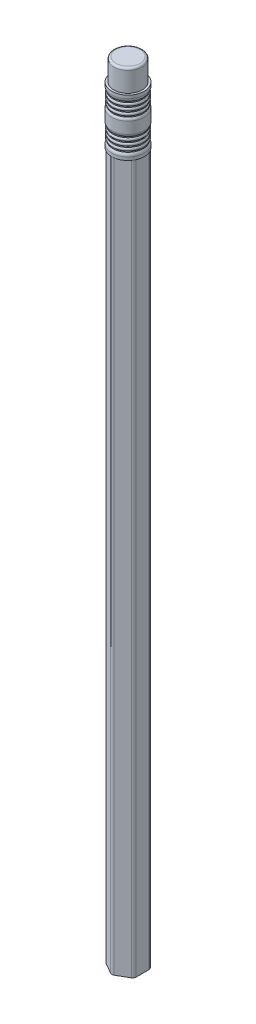
ISO-10303-21;
HEADER;
FILE_DESCRIPTION(('STEP AP214'),'2;1');
FILE_NAME('part.step','',(''),(''),'','','');
FILE_SCHEMA(('AUTOMOTIVE_DESIGN { 1 0 10303 214 1 1 1 1 }'));
ENDSEC;
DATA;
#1=APPLICATION_CONTEXT('core data for automotive mechanical design processes');
#2=APPLICATION_PROTOCOL_DEFINITION('international standard','automotive_design',2000,#1);
#3=PRODUCT_CONTEXT('',#1,'mechanical');
#4=PRODUCT('Part','Part','',(#3));
#5=PRODUCT_RELATED_PRODUCT_CATEGORY('part','',(#4));
#6=PRODUCT_DEFINITION_FORMATION('','',#4);
#7=PRODUCT_DEFINITION_CONTEXT('part definition',#1,'design');
#8=PRODUCT_DEFINITION('design','',#6,#7);
#9=PRODUCT_DEFINITION_SHAPE('','',#8);
#10=(LENGTH_UNIT() NAMED_UNIT(*) SI_UNIT(.MILLI.,.METRE.));
#11=(NAMED_UNIT(*) PLANE_ANGLE_UNIT() SI_UNIT($,.RADIAN.));
#12=(NAMED_UNIT(*) SI_UNIT($,.STERADIAN.) SOLID_ANGLE_UNIT());
#13=UNCERTAINTY_MEASURE_WITH_UNIT(LENGTH_MEASURE(1.E-05),#10,'distance_accuracy_value','');
#14=(GEOMETRIC_REPRESENTATION_CONTEXT(3) GLOBAL_UNCERTAINTY_ASSIGNED_CONTEXT((#13)) GLOBAL_UNIT_ASSIGNED_CONTEXT((#10,
#11,#12)) REPRESENTATION_CONTEXT('',''));
#15=CARTESIAN_POINT('',(0.,0.,0.));
#16=DIRECTION('',(0.,0.,1.));
#17=DIRECTION('',(1.,0.,0.));
#18=AXIS2_PLACEMENT_3D('',#15,#16,#17);
#19=CARTESIAN_POINT('',(0.,177.8,0.));
#20=DIRECTION('',(0.,-1.,0.));
#21=DIRECTION('',(0.,0.,-1.));
#22=AXIS2_PLACEMENT_3D('',#19,#20,#21);
#23=CYLINDRICAL_SURFACE('',#22,0.9398);
#24=CARTESIAN_POINT('',(0.,177.8,0.));
#25=DIRECTION('',(0.,1.,0.));
#26=DIRECTION('',(0.,0.,1.));
#27=AXIS2_PLACEMENT_3D('',#24,#25,#26);
#28=CIRCLE('',#27,0.9398);
#29=CARTESIAN_POINT('',(0.,177.8,0.9398));
#30=VERTEX_POINT('',#29);
#31=EDGE_CURVE('E215',#30,#30,#28,.T.);
#32=ORIENTED_EDGE('',*,*,#31,.F.);
#33=EDGE_LOOP('',(#32));
#34=FACE_BOUND('',#33,.T.);
#35=CARTESIAN_POINT('',(0.,0.,0.));
#36=DIRECTION('',(0.,1.,0.));
#37=DIRECTION('',(0.,0.,1.));
#38=AXIS2_PLACEMENT_3D('',#35,#36,#37);
#39=CIRCLE('',#38,0.9398);
#40=CARTESIAN_POINT('',(0.,0.,0.9398));
#41=VERTEX_POINT('',#40);
#42=EDGE_CURVE('E218',#41,#41,#39,.T.);
#43=ORIENTED_EDGE('',*,*,#42,.T.);
#44=EDGE_LOOP('',(#43));
#45=FACE_BOUND('',#44,.T.);
#46=ADVANCED_FACE('F32',(#34,#45),#23,.T.);
#47=CARTESIAN_POINT('',(0.,0.,0.));
#48=DIRECTION('',(0.,1.,0.));
#49=DIRECTION('',(0.,0.,1.));
#50=AXIS2_PLACEMENT_3D('',#47,#48,#49);
#51=PLANE('',#50);
#52=ORIENTED_EDGE('',*,*,#42,.F.);
#53=EDGE_LOOP('',(#52));
#54=FACE_BOUND('',#53,.T.);
#55=ADVANCED_FACE('F240',(#54),#51,.F.);
#56=CARTESIAN_POINT('',(0.,177.8,0.));
#57=DIRECTION('',(0.,1.,0.));
#58=DIRECTION('',(0.,0.,1.));
#59=AXIS2_PLACEMENT_3D('',#56,#57,#58);
#60=PLANE('',#59);
#61=CARTESIAN_POINT('',(0.,177.8,0.));
#62=DIRECTION('',(0.,1.,0.));
#63=DIRECTION('',(0.,0.,1.));
#64=AXIS2_PLACEMENT_3D('',#61,#62,#63);
#65=CIRCLE('',#64,0.946620370370371);
#66=CARTESIAN_POINT('',(0.,177.8,0.946620370370371));
#67=VERTEX_POINT('',#66);
#68=EDGE_CURVE('E221',#67,#67,#65,.F.);
#69=ORIENTED_EDGE('',*,*,#68,.T.);
#70=EDGE_LOOP('',(#69));
#71=FACE_BOUND('',#70,.T.);
#72=ORIENTED_EDGE('',*,*,#31,.T.);
#73=EDGE_LOOP('',(#72));
#74=FACE_BOUND('',#73,.T.);
#75=ADVANCED_FACE('F245',(#71,#74),#60,.F.);
#76=CARTESIAN_POINT('',(0.,185.166,0.));
#77=DIRECTION('',(0.,-1.,0.));
#78=DIRECTION('',(0.,0.,-1.));
#79=AXIS2_PLACEMENT_3D('',#76,#77,#78);
#80=CONICAL_SURFACE('',#79,0.939800000000001,0.000925925661315221);
#81=CARTESIAN_POINT('',(0.,171.45,0.));
#82=DIRECTION('',(0.,-1.,0.));
#83=DIRECTION('',(0.,0.,-1.));
#84=AXIS2_PLACEMENT_3D('',#81,#82,#83);
#85=CIRCLE('',#84,0.9525);
#86=CARTESIAN_POINT('',(0.,171.45,-0.9525));
#87=VERTEX_POINT('',#86);
#88=EDGE_CURVE('E408',#87,#87,#85,.T.);
#89=ORIENTED_EDGE('',*,*,#88,.T.);
#90=EDGE_LOOP('',(#89));
#91=FACE_BOUND('',#90,.T.);
#92=ORIENTED_EDGE('',*,*,#68,.F.);
#93=EDGE_LOOP('',(#92));
#94=FACE_BOUND('',#93,.T.);
#95=ADVANCED_FACE('F253',(#91,#94),#80,.F.);
#96=CARTESIAN_POINT('',(0.,185.166,-0.939800000000001));
#97=DIRECTION('',(0.,1.,0.));
#98=DIRECTION('',(0.,0.,1.));
#99=AXIS2_PLACEMENT_3D('',#96,#97,#98);
#100=PLANE('',#99);
#101=CARTESIAN_POINT('',(0.,185.166,0.));
#102=DIRECTION('',(0.,-1.,0.));
#103=DIRECTION('',(0.,0.,-1.));
#104=AXIS2_PLACEMENT_3D('',#101,#102,#103);
#105=CIRCLE('',#104,3.93699999999998);
#106=CARTESIAN_POINT('',(0.,185.166,-3.93699999999998));
#107=VERTEX_POINT('',#106);
#108=EDGE_CURVE('E411',#107,#107,#105,.T.);
#109=ORIENTED_EDGE('',*,*,#108,.F.);
#110=EDGE_LOOP('',(#109));
#111=FACE_BOUND('',#110,.T.);
#112=CARTESIAN_POINT('',(0.,185.166,0.));
#113=DIRECTION('',(0.,1.,0.));
#114=DIRECTION('',(0.,0.,1.));
#115=AXIS2_PLACEMENT_3D('',#112,#113,#114);
#116=CIRCLE('',#115,3.429);
#117=CARTESIAN_POINT('',(0.,185.166,3.429));
#118=VERTEX_POINT('',#117);
#119=EDGE_CURVE('E214',#118,#118,#116,.T.);
#120=ORIENTED_EDGE('',*,*,#119,.F.);
#121=EDGE_LOOP('',(#120));
#122=FACE_BOUND('',#121,.T.);
#123=ADVANCED_FACE('F303',(#111,#122),#100,.T.);
#124=CARTESIAN_POINT('',(-2.7305,0.,1.57645491002227));
#125=DIRECTION('',(0.,1.,0.));
#126=DIRECTION('',(0.,0.,1.));
#127=AXIS2_PLACEMENT_3D('',#124,#125,#126);
#128=PLANE('',#127);
#129=CARTESIAN_POINT('',(-2.7305,0.,1.57645491002227));
#130=DIRECTION('',(0.,1.,0.));
#131=DIRECTION('',(0.,0.,1.));
#132=AXIS2_PLACEMENT_3D('',#129,#130,#131);
#133=CIRCLE('',#132,0.762);
#134=CARTESIAN_POINT('',(-3.4925,0.,1.57645491002227));
#135=VERTEX_POINT('',#134);
#136=CARTESIAN_POINT('',(-3.1115,0.,2.23636626770602));
#137=VERTEX_POINT('',#136);
#138=EDGE_CURVE('E166',#135,#137,#133,.T.);
#139=ORIENTED_EDGE('',*,*,#138,.F.);
#140=DIRECTION('',(0.,0.,1.));
#141=VECTOR('',#140,1.);
#142=CARTESIAN_POINT('',(-3.4925,0.,-1.57645491002227));
#143=LINE('',#142,#141);
#144=CARTESIAN_POINT('',(-3.4925,0.,-1.57645491002227));
#145=VERTEX_POINT('',#144);
#146=EDGE_CURVE('E95',#145,#135,#143,.T.);
#147=ORIENTED_EDGE('',*,*,#146,.F.);
#148=CARTESIAN_POINT('',(-2.7305,0.,-1.57645491002227));
#149=DIRECTION('',(0.,1.,0.));
#150=DIRECTION('',(0.,0.,1.));
#151=AXIS2_PLACEMENT_3D('',#148,#149,#150);
#152=CIRCLE('',#151,0.762);
#153=CARTESIAN_POINT('',(-3.1115,0.,-2.23636626770602));
#154=VERTEX_POINT('',#153);
#155=EDGE_CURVE('E89',#154,#145,#152,.T.);
#156=ORIENTED_EDGE('',*,*,#155,.F.);
#157=DIRECTION('',(-0.866025403784439,0.,0.5));
#158=VECTOR('',#157,1.);
#159=CARTESIAN_POINT('',(-0.381,0.,-3.81282117772829));
#160=LINE('',#159,#158);
#161=CARTESIAN_POINT('',(-0.381,0.,-3.81282117772829));
#162=VERTEX_POINT('',#161);
#163=EDGE_CURVE('E185',#162,#154,#160,.T.);
#164=ORIENTED_EDGE('',*,*,#163,.F.);
#165=CARTESIAN_POINT('',(0.,0.,-3.15290982004455));
#166=DIRECTION('',(0.,1.,0.));
#167=DIRECTION('',(0.,0.,1.));
#168=AXIS2_PLACEMENT_3D('',#165,#166,#167);
#169=CIRCLE('',#168,0.762);
#170=CARTESIAN_POINT('',(0.381000000000001,0.,-3.81282117772829));
#171=VERTEX_POINT('',#170);
#172=EDGE_CURVE('E138',#171,#162,#169,.T.);
#173=ORIENTED_EDGE('',*,*,#172,.F.);
#174=DIRECTION('',(-0.866025403784439,0.,-0.5));
#175=VECTOR('',#174,1.);
#176=CARTESIAN_POINT('',(3.1115,0.,-2.23636626770602));
#177=LINE('',#176,#175);
#178=CARTESIAN_POINT('',(3.1115,0.,-2.23636626770602));
#179=VERTEX_POINT('',#178);
#180=EDGE_CURVE('E182',#179,#171,#177,.T.);
#181=ORIENTED_EDGE('',*,*,#180,.F.);
#182=CARTESIAN_POINT('',(2.7305,0.,-1.57645491002227));
#183=DIRECTION('',(0.,1.,0.));
#184=DIRECTION('',(0.,0.,1.));
#185=AXIS2_PLACEMENT_3D('',#182,#183,#184);
#186=CIRCLE('',#185,0.762);
#187=CARTESIAN_POINT('',(3.4925,0.,-1.57645491002227));
#188=VERTEX_POINT('',#187);
#189=EDGE_CURVE('E180',#188,#179,#186,.T.);
#190=ORIENTED_EDGE('',*,*,#189,.F.);
#191=DIRECTION('',(0.,0.,-1.));
#192=VECTOR('',#191,1.);
#193=CARTESIAN_POINT('',(3.4925,0.,1.57645491002227));
#194=LINE('',#193,#192);
#195=CARTESIAN_POINT('',(3.4925,0.,1.57645491002227));
#196=VERTEX_POINT('',#195);
#197=EDGE_CURVE('E178',#196,#188,#194,.T.);
#198=ORIENTED_EDGE('',*,*,#197,.F.);
#199=CARTESIAN_POINT('',(2.7305,0.,1.57645491002227));
#200=DIRECTION('',(0.,1.,0.));
#201=DIRECTION('',(0.,0.,1.));
#202=AXIS2_PLACEMENT_3D('',#199,#200,#201);
#203=CIRCLE('',#202,0.762);
#204=CARTESIAN_POINT('',(3.1115,0.,2.23636626770602));
#205=VERTEX_POINT('',#204);
#206=EDGE_CURVE('E176',#205,#196,#203,.T.);
#207=ORIENTED_EDGE('',*,*,#206,.F.);
#208=DIRECTION('',(0.866025403784439,0.,-0.5));
#209=VECTOR('',#208,1.);
#210=CARTESIAN_POINT('',(0.381,0.,3.81282117772829));
#211=LINE('',#210,#209);
#212=CARTESIAN_POINT('',(0.381,0.,3.81282117772829));
#213=VERTEX_POINT('',#212);
#214=EDGE_CURVE('E174',#213,#205,#211,.T.);
#215=ORIENTED_EDGE('',*,*,#214,.F.);
#216=CARTESIAN_POINT('',(0.,0.,3.15290982004455));
#217=DIRECTION('',(0.,1.,0.));
#218=DIRECTION('',(0.,0.,-1.));
#219=AXIS2_PLACEMENT_3D('',#216,#217,#218);
#220=CIRCLE('',#219,0.762);
#221=CARTESIAN_POINT('',(-0.381,0.,3.81282117772829));
#222=VERTEX_POINT('',#221);
#223=EDGE_CURVE('E172',#222,#213,#220,.T.);
#224=ORIENTED_EDGE('',*,*,#223,.F.);
#225=DIRECTION('',(0.866025403784439,0.,0.5));
#226=VECTOR('',#225,1.);
#227=CARTESIAN_POINT('',(-3.1115,0.,2.23636626770602));
#228=LINE('',#227,#226);
#229=EDGE_CURVE('E169',#137,#222,#228,.T.);
#230=ORIENTED_EDGE('',*,*,#229,.F.);
#231=EDGE_LOOP('',(#139,#147,#156,#164,#173,#181,#190,#198,#207,#215,#224,#230));
#232=FACE_BOUND('',#231,.T.);
#233=CARTESIAN_POINT('',(0.,0.,0.));
#234=DIRECTION('',(0.,1.,0.));
#235=DIRECTION('',(0.,0.,1.));
#236=AXIS2_PLACEMENT_3D('',#233,#234,#235);
#237=CIRCLE('',#236,0.9525);
#238=CARTESIAN_POINT('',(0.,0.,0.9525));
#239=VERTEX_POINT('',#238);
#240=EDGE_CURVE('E170',#239,#239,#237,.T.);
#241=ORIENTED_EDGE('',*,*,#240,.T.);
#242=EDGE_LOOP('',(#241));
#243=FACE_BOUND('',#242,.T.);
#244=ADVANCED_FACE('F262',(#232,#243),#128,.F.);
#245=CARTESIAN_POINT('',(-2.7305,171.45,1.57645491002227));
#246=DIRECTION('',(0.,-1.,0.));
#247=DIRECTION('',(0.,0.,-1.));
#248=AXIS2_PLACEMENT_3D('',#245,#246,#247);
#249=CYLINDRICAL_SURFACE('',#248,0.762);
#250=ORIENTED_EDGE('',*,*,#138,.T.);
#251=DIRECTION('',(0.,-1.,0.));
#252=VECTOR('',#251,1.);
#253=CARTESIAN_POINT('',(-3.1115,171.45,2.23636626770602));
#254=LINE('',#253,#252);
#255=CARTESIAN_POINT('',(-3.1115,171.45,2.23636626770602));
#256=VERTEX_POINT('',#255);
#257=EDGE_CURVE('E212',#256,#137,#254,.T.);
#258=ORIENTED_EDGE('',*,*,#257,.F.);
#259=CARTESIAN_POINT('',(-2.7305,171.45,1.57645491002227));
#260=DIRECTION('',(0.,1.,0.));
#261=DIRECTION('',(0.,0.,1.));
#262=AXIS2_PLACEMENT_3D('',#259,#260,#261);
#263=CIRCLE('',#262,0.762);
#264=CARTESIAN_POINT('',(-3.4925,171.45,1.57645491002227));
#265=VERTEX_POINT('',#264);
#266=EDGE_CURVE('E189',#265,#256,#263,.T.);
#267=ORIENTED_EDGE('',*,*,#266,.F.);
#268=DIRECTION('',(0.,-1.,0.));
#269=VECTOR('',#268,1.);
#270=CARTESIAN_POINT('',(-3.4925,171.45,1.57645491002227));
#271=LINE('',#270,#269);
#272=EDGE_CURVE('E165',#265,#135,#271,.T.);
#273=ORIENTED_EDGE('',*,*,#272,.T.);
#274=EDGE_LOOP('',(#250,#258,#267,#273));
#275=FACE_BOUND('',#274,.T.);
#276=ADVANCED_FACE('F258',(#275),#249,.T.);
#277=CARTESIAN_POINT('',(-3.1115,171.45,2.23636626770602));
#278=DIRECTION('',(0.5,0.,-0.866025403784438));
#279=DIRECTION('',(-0.866025403784439,0.,-0.5));
#280=AXIS2_PLACEMENT_3D('',#277,#278,#279);
#281=PLANE('',#280);
#282=ORIENTED_EDGE('',*,*,#229,.T.);
#283=DIRECTION('',(0.,-1.,0.));
#284=VECTOR('',#283,1.);
#285=CARTESIAN_POINT('',(-0.381,171.45,3.81282117772829));
#286=LINE('',#285,#284);
#287=CARTESIAN_POINT('',(-0.381,171.45,3.81282117772829));
#288=VERTEX_POINT('',#287);
#289=EDGE_CURVE('E209',#288,#222,#286,.T.);
#290=ORIENTED_EDGE('',*,*,#289,.F.);
#291=DIRECTION('',(0.866025403784439,0.,0.5));
#292=VECTOR('',#291,1.);
#293=CARTESIAN_POINT('',(-3.1115,171.45,2.23636626770602));
#294=LINE('',#293,#292);
#295=EDGE_CURVE('E104',#256,#288,#294,.T.);
#296=ORIENTED_EDGE('',*,*,#295,.F.);
#297=ORIENTED_EDGE('',*,*,#257,.T.);
#298=EDGE_LOOP('',(#282,#290,#296,#297));
#299=FACE_BOUND('',#298,.T.);
#300=ADVANCED_FACE('F261',(#299),#281,.F.);
#301=CARTESIAN_POINT('',(0.,171.45,3.15290982004455));
#302=DIRECTION('',(0.,-1.,0.));
#303=DIRECTION('',(0.,0.,-1.));
#304=AXIS2_PLACEMENT_3D('',#301,#302,#303);
#305=CYLINDRICAL_SURFACE('',#304,0.762);
#306=ORIENTED_EDGE('',*,*,#223,.T.);
#307=DIRECTION('',(0.,-1.,0.));
#308=VECTOR('',#307,1.);
#309=CARTESIAN_POINT('',(0.381,171.45,3.81282117772829));
#310=LINE('',#309,#308);
#311=CARTESIAN_POINT('',(0.381,171.45,3.81282117772829));
#312=VERTEX_POINT('',#311);
#313=EDGE_CURVE('E206',#312,#213,#310,.T.);
#314=ORIENTED_EDGE('',*,*,#313,.F.);
#315=CARTESIAN_POINT('',(0.,171.45,3.15290982004455));
#316=DIRECTION('',(0.,1.,0.));
#317=DIRECTION('',(0.,0.,-1.));
#318=AXIS2_PLACEMENT_3D('',#315,#316,#317);
#319=CIRCLE('',#318,0.762);
#320=EDGE_CURVE('E478',#288,#312,#319,.T.);
#321=ORIENTED_EDGE('',*,*,#320,.F.);
#322=ORIENTED_EDGE('',*,*,#289,.T.);
#323=EDGE_LOOP('',(#306,#314,#321,#322));
#324=FACE_BOUND('',#323,.T.);
#325=ADVANCED_FACE('F266',(#324),#305,.T.);
#326=CARTESIAN_POINT('',(0.381,171.45,3.81282117772829));
#327=DIRECTION('',(-0.5,0.,-0.866025403784438));
#328=DIRECTION('',(-0.866025403784439,0.,0.5));
#329=AXIS2_PLACEMENT_3D('',#326,#327,#328);
#330=PLANE('',#329);
#331=ORIENTED_EDGE('',*,*,#214,.T.);
#332=DIRECTION('',(0.,-1.,0.));
#333=VECTOR('',#332,1.);
#334=CARTESIAN_POINT('',(3.1115,171.45,2.23636626770602));
#335=LINE('',#334,#333);
#336=CARTESIAN_POINT('',(3.1115,171.45,2.23636626770602));
#337=VERTEX_POINT('',#336);
#338=EDGE_CURVE('E203',#337,#205,#335,.T.);
#339=ORIENTED_EDGE('',*,*,#338,.F.);
#340=DIRECTION('',(0.866025403784439,0.,-0.5));
#341=VECTOR('',#340,1.);
#342=CARTESIAN_POINT('',(0.381,171.45,3.81282117772829));
#343=LINE('',#342,#341);
#344=EDGE_CURVE('E481',#312,#337,#343,.T.);
#345=ORIENTED_EDGE('',*,*,#344,.F.);
#346=ORIENTED_EDGE('',*,*,#313,.T.);
#347=EDGE_LOOP('',(#331,#339,#345,#346));
#348=FACE_BOUND('',#347,.T.);
#349=ADVANCED_FACE('F269',(#348),#330,.F.);
#350=CARTESIAN_POINT('',(2.7305,171.45,1.57645491002227));
#351=DIRECTION('',(0.,-1.,0.));
#352=DIRECTION('',(0.,0.,-1.));
#353=AXIS2_PLACEMENT_3D('',#350,#351,#352);
#354=CYLINDRICAL_SURFACE('',#353,0.762);
#355=ORIENTED_EDGE('',*,*,#206,.T.);
#356=DIRECTION('',(0.,-1.,0.));
#357=VECTOR('',#356,1.);
#358=CARTESIAN_POINT('',(3.4925,171.45,1.57645491002227));
#359=LINE('',#358,#357);
#360=CARTESIAN_POINT('',(3.4925,171.45,1.57645491002227));
#361=VERTEX_POINT('',#360);
#362=EDGE_CURVE('E200',#361,#196,#359,.T.);
#363=ORIENTED_EDGE('',*,*,#362,.F.);
#364=CARTESIAN_POINT('',(2.7305,171.45,1.57645491002227));
#365=DIRECTION('',(0.,1.,0.));
#366=DIRECTION('',(0.,0.,1.));
#367=AXIS2_PLACEMENT_3D('',#364,#365,#366);
#368=CIRCLE('',#367,0.762);
#369=EDGE_CURVE('E484',#337,#361,#368,.T.);
#370=ORIENTED_EDGE('',*,*,#369,.F.);
#371=ORIENTED_EDGE('',*,*,#338,.T.);
#372=EDGE_LOOP('',(#355,#363,#370,#371));
#373=FACE_BOUND('',#372,.T.);
#374=ADVANCED_FACE('F273',(#373),#354,.T.);
#375=CARTESIAN_POINT('',(3.4925,171.45,1.57645491002227));
#376=DIRECTION('',(-1.,0.,0.));
#377=DIRECTION('',(0.,0.,1.));
#378=AXIS2_PLACEMENT_3D('',#375,#376,#377);
#379=PLANE('',#378);
#380=ORIENTED_EDGE('',*,*,#197,.T.);
#381=DIRECTION('',(0.,-1.,0.));
#382=VECTOR('',#381,1.);
#383=CARTESIAN_POINT('',(3.4925,171.45,-1.57645491002227));
#384=LINE('',#383,#382);
#385=CARTESIAN_POINT('',(3.4925,171.45,-1.57645491002227));
#386=VERTEX_POINT('',#385);
#387=EDGE_CURVE('E197',#386,#188,#384,.T.);
#388=ORIENTED_EDGE('',*,*,#387,.F.);
#389=DIRECTION('',(0.,0.,-1.));
#390=VECTOR('',#389,1.);
#391=CARTESIAN_POINT('',(3.4925,171.45,1.57645491002227));
#392=LINE('',#391,#390);
#393=EDGE_CURVE('E487',#361,#386,#392,.T.);
#394=ORIENTED_EDGE('',*,*,#393,.F.);
#395=ORIENTED_EDGE('',*,*,#362,.T.);
#396=EDGE_LOOP('',(#380,#388,#394,#395));
#397=FACE_BOUND('',#396,.T.);
#398=ADVANCED_FACE('F277',(#397),#379,.F.);
#399=CARTESIAN_POINT('',(2.7305,171.45,-1.57645491002227));
#400=DIRECTION('',(0.,-1.,0.));
#401=DIRECTION('',(0.,0.,-1.));
#402=AXIS2_PLACEMENT_3D('',#399,#400,#401);
#403=CYLINDRICAL_SURFACE('',#402,0.762);
#404=ORIENTED_EDGE('',*,*,#189,.T.);
#405=DIRECTION('',(0.,-1.,0.));
#406=VECTOR('',#405,1.);
#407=CARTESIAN_POINT('',(3.1115,171.45,-2.23636626770602));
#408=LINE('',#407,#406);
#409=CARTESIAN_POINT('',(3.1115,171.45,-2.23636626770602));
#410=VERTEX_POINT('',#409);
#411=EDGE_CURVE('E194',#410,#179,#408,.T.);
#412=ORIENTED_EDGE('',*,*,#411,.F.);
#413=CARTESIAN_POINT('',(2.7305,171.45,-1.57645491002227));
#414=DIRECTION('',(0.,1.,0.));
#415=DIRECTION('',(0.,0.,1.));
#416=AXIS2_PLACEMENT_3D('',#413,#414,#415);
#417=CIRCLE('',#416,0.762);
#418=EDGE_CURVE('E157',#386,#410,#417,.T.);
#419=ORIENTED_EDGE('',*,*,#418,.F.);
#420=ORIENTED_EDGE('',*,*,#387,.T.);
#421=EDGE_LOOP('',(#404,#412,#419,#420));
#422=FACE_BOUND('',#421,.T.);
#423=ADVANCED_FACE('F281',(#422),#403,.T.);
#424=CARTESIAN_POINT('',(3.1115,171.45,-2.23636626770602));
#425=DIRECTION('',(-0.5,0.,0.866025403784439));
#426=DIRECTION('',(0.866025403784439,0.,0.5));
#427=AXIS2_PLACEMENT_3D('',#424,#425,#426);
#428=PLANE('',#427);
#429=ORIENTED_EDGE('',*,*,#180,.T.);
#430=DIRECTION('',(0.,-1.,0.));
#431=VECTOR('',#430,1.);
#432=CARTESIAN_POINT('',(0.381000000000001,171.45,-3.81282117772829));
#433=LINE('',#432,#431);
#434=CARTESIAN_POINT('',(0.381000000000001,171.45,-3.81282117772829));
#435=VERTEX_POINT('',#434);
#436=EDGE_CURVE('E141',#435,#171,#433,.T.);
#437=ORIENTED_EDGE('',*,*,#436,.F.);
#438=DIRECTION('',(-0.866025403784439,0.,-0.5));
#439=VECTOR('',#438,1.);
#440=CARTESIAN_POINT('',(3.1115,171.45,-2.23636626770602));
#441=LINE('',#440,#439);
#442=EDGE_CURVE('E155',#410,#435,#441,.T.);
#443=ORIENTED_EDGE('',*,*,#442,.F.);
#444=ORIENTED_EDGE('',*,*,#411,.T.);
#445=EDGE_LOOP('',(#429,#437,#443,#444));
#446=FACE_BOUND('',#445,.T.);
#447=ADVANCED_FACE('F285',(#446),#428,.F.);
#448=CARTESIAN_POINT('',(0.,171.45,-3.15290982004455));
#449=DIRECTION('',(0.,-1.,0.));
#450=DIRECTION('',(0.,0.,-1.));
#451=AXIS2_PLACEMENT_3D('',#448,#449,#450);
#452=CYLINDRICAL_SURFACE('',#451,0.762);
#453=ORIENTED_EDGE('',*,*,#172,.T.);
#454=DIRECTION('',(0.,-1.,0.));
#455=VECTOR('',#454,1.);
#456=CARTESIAN_POINT('',(-0.381,171.45,-3.81282117772829));
#457=LINE('',#456,#455);
#458=CARTESIAN_POINT('',(-0.381,171.45,-3.81282117772829));
#459=VERTEX_POINT('',#458);
#460=EDGE_CURVE('E130',#459,#162,#457,.T.);
#461=ORIENTED_EDGE('',*,*,#460,.F.);
#462=CARTESIAN_POINT('',(0.,171.45,-3.15290982004455));
#463=DIRECTION('',(0.,1.,0.));
#464=DIRECTION('',(0.,0.,1.));
#465=AXIS2_PLACEMENT_3D('',#462,#463,#464);
#466=CIRCLE('',#465,0.762);
#467=EDGE_CURVE('E135',#435,#459,#466,.T.);
#468=ORIENTED_EDGE('',*,*,#467,.F.);
#469=ORIENTED_EDGE('',*,*,#436,.T.);
#470=EDGE_LOOP('',(#453,#461,#468,#469));
#471=FACE_BOUND('',#470,.T.);
#472=ADVANCED_FACE('F132',(#471),#452,.T.);
#473=CARTESIAN_POINT('',(-0.381,171.45,-3.81282117772829));
#474=DIRECTION('',(0.5,0.,0.866025403784438));
#475=DIRECTION('',(0.866025403784439,0.,-0.5));
#476=AXIS2_PLACEMENT_3D('',#473,#474,#475);
#477=PLANE('',#476);
#478=ORIENTED_EDGE('',*,*,#163,.T.);
#479=DIRECTION('',(0.,-1.,0.));
#480=VECTOR('',#479,1.);
#481=CARTESIAN_POINT('',(-3.1115,171.45,-2.23636626770602));
#482=LINE('',#481,#480);
#483=CARTESIAN_POINT('',(-3.1115,171.45,-2.23636626770602));
#484=VERTEX_POINT('',#483);
#485=EDGE_CURVE('E142',#484,#154,#482,.T.);
#486=ORIENTED_EDGE('',*,*,#485,.F.);
#487=DIRECTION('',(-0.866025403784439,0.,0.5));
#488=VECTOR('',#487,1.);
#489=CARTESIAN_POINT('',(-0.381,171.45,-3.81282117772829));
#490=LINE('',#489,#488);
#491=EDGE_CURVE('E145',#459,#484,#490,.T.);
#492=ORIENTED_EDGE('',*,*,#491,.F.);
#493=ORIENTED_EDGE('',*,*,#460,.T.);
#494=EDGE_LOOP('',(#478,#486,#492,#493));
#495=FACE_BOUND('',#494,.T.);
#496=ADVANCED_FACE('F146',(#495),#477,.F.);
#497=CARTESIAN_POINT('',(-2.7305,171.45,-1.57645491002227));
#498=DIRECTION('',(0.,-1.,0.));
#499=DIRECTION('',(0.,0.,-1.));
#500=AXIS2_PLACEMENT_3D('',#497,#498,#499);
#501=CYLINDRICAL_SURFACE('',#500,0.762);
#502=ORIENTED_EDGE('',*,*,#155,.T.);
#503=DIRECTION('',(0.,-1.,0.));
#504=VECTOR('',#503,1.);
#505=CARTESIAN_POINT('',(-3.4925,171.45,-1.57645491002227));
#506=LINE('',#505,#504);
#507=CARTESIAN_POINT('',(-3.4925,171.45,-1.57645491002227));
#508=VERTEX_POINT('',#507);
#509=EDGE_CURVE('E49',#508,#145,#506,.T.);
#510=ORIENTED_EDGE('',*,*,#509,.F.);
#511=CARTESIAN_POINT('',(-2.7305,171.45,-1.57645491002227));
#512=DIRECTION('',(0.,1.,0.));
#513=DIRECTION('',(0.,0.,1.));
#514=AXIS2_PLACEMENT_3D('',#511,#512,#513);
#515=CIRCLE('',#514,0.762);
#516=EDGE_CURVE('E149',#484,#508,#515,.T.);
#517=ORIENTED_EDGE('',*,*,#516,.F.);
#518=ORIENTED_EDGE('',*,*,#485,.T.);
#519=EDGE_LOOP('',(#502,#510,#517,#518));
#520=FACE_BOUND('',#519,.T.);
#521=ADVANCED_FACE('F294',(#520),#501,.T.);
#522=CARTESIAN_POINT('',(-3.4925,171.45,-1.57645491002227));
#523=DIRECTION('',(1.,0.,0.));
#524=DIRECTION('',(0.,0.,-1.));
#525=AXIS2_PLACEMENT_3D('',#522,#523,#524);
#526=PLANE('',#525);
#527=ORIENTED_EDGE('',*,*,#146,.T.);
#528=ORIENTED_EDGE('',*,*,#272,.F.);
#529=DIRECTION('',(0.,0.,1.));
#530=VECTOR('',#529,1.);
#531=CARTESIAN_POINT('',(-3.4925,171.45,-1.57645491002227));
#532=LINE('',#531,#530);
#533=EDGE_CURVE('E162',#508,#265,#532,.T.);
#534=ORIENTED_EDGE('',*,*,#533,.F.);
#535=ORIENTED_EDGE('',*,*,#509,.T.);
#536=EDGE_LOOP('',(#527,#528,#534,#535));
#537=FACE_BOUND('',#536,.T.);
#538=ADVANCED_FACE('F297',(#537),#526,.F.);
#539=CARTESIAN_POINT('',(0.,171.45,0.));
#540=DIRECTION('',(0.,-1.,0.));
#541=DIRECTION('',(0.,0.,-1.));
#542=AXIS2_PLACEMENT_3D('',#539,#540,#541);
#543=CYLINDRICAL_SURFACE('',#542,0.9525);
#544=ORIENTED_EDGE('',*,*,#88,.F.);
#545=EDGE_LOOP('',(#544));
#546=FACE_BOUND('',#545,.T.);
#547=ORIENTED_EDGE('',*,*,#240,.F.);
#548=EDGE_LOOP('',(#547));
#549=FACE_BOUND('',#548,.T.);
#550=ADVANCED_FACE('F300',(#546,#549),#543,.F.);
#551=CARTESIAN_POINT('',(0.,171.45,-0.9525));
#552=DIRECTION('',(0.,-1.,0.));
#553=DIRECTION('',(0.,0.,-1.));
#554=AXIS2_PLACEMENT_3D('',#551,#552,#553);
#555=PLANE('',#554);
#556=CARTESIAN_POINT('',(0.,171.45,0.));
#557=DIRECTION('',(0.,-1.,0.));
#558=DIRECTION('',(0.,0.,-1.));
#559=AXIS2_PLACEMENT_3D('',#556,#557,#558);
#560=CIRCLE('',#559,3.937);
#561=CARTESIAN_POINT('',(0.,171.45,-3.937));
#562=VERTEX_POINT('',#561);
#563=EDGE_CURVE('E407',#562,#562,#560,.T.);
#564=ORIENTED_EDGE('',*,*,#563,.T.);
#565=EDGE_LOOP('',(#564));
#566=FACE_BOUND('',#565,.T.);
#567=ORIENTED_EDGE('',*,*,#266,.T.);
#568=ORIENTED_EDGE('',*,*,#295,.T.);
#569=ORIENTED_EDGE('',*,*,#320,.T.);
#570=ORIENTED_EDGE('',*,*,#344,.T.);
#571=ORIENTED_EDGE('',*,*,#369,.T.);
#572=ORIENTED_EDGE('',*,*,#393,.T.);
#573=ORIENTED_EDGE('',*,*,#418,.T.);
#574=ORIENTED_EDGE('',*,*,#442,.T.);
#575=ORIENTED_EDGE('',*,*,#467,.T.);
#576=ORIENTED_EDGE('',*,*,#491,.T.);
#577=ORIENTED_EDGE('',*,*,#516,.T.);
#578=ORIENTED_EDGE('',*,*,#533,.T.);
#579=EDGE_LOOP('',(#567,#568,#569,#570,#571,#572,#573,#574,#575,#576,#577,#578));
#580=FACE_BOUND('',#579,.T.);
#581=ADVANCED_FACE('F152',(#566,#580),#555,.T.);
#582=CARTESIAN_POINT('',(0.,172.212,0.));
#583=DIRECTION('',(0.,-1.,0.));
#584=DIRECTION('',(0.,0.,-1.));
#585=AXIS2_PLACEMENT_3D('',#582,#583,#584);
#586=TOROIDAL_SURFACE('',#585,2.75820909090928,1.1787909090908);
#587=CARTESIAN_POINT('',(0.,172.974,0.));
#588=DIRECTION('',(0.,-1.,0.));
#589=DIRECTION('',(0.,0.,-1.));
#590=AXIS2_PLACEMENT_3D('',#587,#588,#589);
#591=CIRCLE('',#590,3.6576);
#592=CARTESIAN_POINT('',(0.,172.974,-3.6576));
#593=VERTEX_POINT('',#592);
#594=EDGE_CURVE('E471',#593,#593,#591,.T.);
#595=ORIENTED_EDGE('',*,*,#594,.T.);
#596=EDGE_LOOP('',(#595));
#597=FACE_BOUND('',#596,.T.);
#598=CARTESIAN_POINT('',(0.,172.212,0.));
#599=DIRECTION('',(0.,-1.,0.));
#600=DIRECTION('',(0.,0.,-1.));
#601=AXIS2_PLACEMENT_3D('',#598,#599,#600);
#602=CIRCLE('',#601,3.93700000000013);
#603=CARTESIAN_POINT('',(0.,172.212,-3.93700000000013));
#604=VERTEX_POINT('',#603);
#605=EDGE_CURVE('E404',#604,#604,#602,.T.);
#606=ORIENTED_EDGE('',*,*,#605,.F.);
#607=EDGE_LOOP('',(#606));
#608=FACE_BOUND('',#607,.T.);
#609=ADVANCED_FACE('F308',(#597,#608),#586,.T.);
#610=CARTESIAN_POINT('',(0.,0.,0.));
#611=DIRECTION('',(0.,-1.,0.));
#612=DIRECTION('',(0.,0.,-1.));
#613=AXIS2_PLACEMENT_3D('',#610,#611,#612);
#614=CYLINDRICAL_SURFACE('',#613,3.65760000000001);
#615=CARTESIAN_POINT('',(0.,173.228,0.));
#616=DIRECTION('',(0.,-1.,0.));
#617=DIRECTION('',(0.,0.,-1.));
#618=AXIS2_PLACEMENT_3D('',#615,#616,#617);
#619=CIRCLE('',#618,3.65760000000001);
#620=CARTESIAN_POINT('',(0.,173.228,-3.65760000000001));
#621=VERTEX_POINT('',#620);
#622=EDGE_CURVE('E468',#621,#621,#619,.T.);
#623=ORIENTED_EDGE('',*,*,#622,.T.);
#624=EDGE_LOOP('',(#623));
#625=FACE_BOUND('',#624,.T.);
#626=ORIENTED_EDGE('',*,*,#594,.F.);
#627=EDGE_LOOP('',(#626));
#628=FACE_BOUND('',#627,.T.);
#629=ADVANCED_FACE('F311',(#625,#628),#614,.T.);
#630=CARTESIAN_POINT('',(0.,173.609,0.));
#631=DIRECTION('',(0.,-1.,0.));
#632=DIRECTION('',(0.,0.,-1.));
#633=AXIS2_PLACEMENT_3D('',#630,#631,#632);
#634=TOROIDAL_SURFACE('',#633,3.4020125,0.458787500000005);
#635=CARTESIAN_POINT('',(0.,173.99,0.));
#636=DIRECTION('',(0.,-1.,0.));
#637=DIRECTION('',(0.,0.,-1.));
#638=AXIS2_PLACEMENT_3D('',#635,#636,#637);
#639=CIRCLE('',#638,3.6576);
#640=CARTESIAN_POINT('',(0.,173.99,-3.6576));
#641=VERTEX_POINT('',#640);
#642=EDGE_CURVE('E465',#641,#641,#639,.T.);
#643=ORIENTED_EDGE('',*,*,#642,.T.);
#644=EDGE_LOOP('',(#643));
#645=FACE_BOUND('',#644,.T.);
#646=ORIENTED_EDGE('',*,*,#622,.F.);
#647=EDGE_LOOP('',(#646));
#648=FACE_BOUND('',#647,.T.);
#649=ADVANCED_FACE('F315',(#645,#648),#634,.T.);
#650=CARTESIAN_POINT('',(0.,0.,0.));
#651=DIRECTION('',(0.,-1.,0.));
#652=DIRECTION('',(0.,0.,-1.));
#653=AXIS2_PLACEMENT_3D('',#650,#651,#652);
#654=CYLINDRICAL_SURFACE('',#653,3.6576);
#655=CARTESIAN_POINT('',(0.,174.244,0.));
#656=DIRECTION('',(0.,-1.,0.));
#657=DIRECTION('',(0.,0.,-1.));
#658=AXIS2_PLACEMENT_3D('',#655,#656,#657);
#659=CIRCLE('',#658,3.6576);
#660=CARTESIAN_POINT('',(0.,174.244,-3.6576));
#661=VERTEX_POINT('',#660);
#662=EDGE_CURVE('E462',#661,#661,#659,.T.);
#663=ORIENTED_EDGE('',*,*,#662,.T.);
#664=EDGE_LOOP('',(#663));
#665=FACE_BOUND('',#664,.T.);
#666=ORIENTED_EDGE('',*,*,#642,.F.);
#667=EDGE_LOOP('',(#666));
#668=FACE_BOUND('',#667,.T.);
#669=ADVANCED_FACE('F319',(#665,#668),#654,.T.);
#670=CARTESIAN_POINT('',(0.,174.625,0.));
#671=DIRECTION('',(0.,-1.,0.));
#672=DIRECTION('',(0.,0.,-1.));
#673=AXIS2_PLACEMENT_3D('',#670,#671,#672);
#674=TOROIDAL_SURFACE('',#673,3.4020125,0.458787499999994);
#675=CARTESIAN_POINT('',(0.,175.006,0.));
#676=DIRECTION('',(0.,-1.,0.));
#677=DIRECTION('',(0.,0.,-1.));
#678=AXIS2_PLACEMENT_3D('',#675,#676,#677);
#679=CIRCLE('',#678,3.6576);
#680=CARTESIAN_POINT('',(0.,175.006,-3.6576));
#681=VERTEX_POINT('',#680);
#682=EDGE_CURVE('E459',#681,#681,#679,.T.);
#683=ORIENTED_EDGE('',*,*,#682,.T.);
#684=EDGE_LOOP('',(#683));
#685=FACE_BOUND('',#684,.T.);
#686=ORIENTED_EDGE('',*,*,#662,.F.);
#687=EDGE_LOOP('',(#686));
#688=FACE_BOUND('',#687,.T.);
#689=ADVANCED_FACE('F323',(#685,#688),#674,.T.);
#690=CARTESIAN_POINT('',(0.,0.,0.));
#691=DIRECTION('',(0.,-1.,0.));
#692=DIRECTION('',(0.,0.,-1.));
#693=AXIS2_PLACEMENT_3D('',#690,#691,#692);
#694=CYLINDRICAL_SURFACE('',#693,3.65760000000001);
#695=CARTESIAN_POINT('',(0.,175.26,0.));
#696=DIRECTION('',(0.,-1.,0.));
#697=DIRECTION('',(0.,0.,-1.));
#698=AXIS2_PLACEMENT_3D('',#695,#696,#697);
#699=CIRCLE('',#698,3.65760000000001);
#700=CARTESIAN_POINT('',(0.,175.26,-3.65760000000001));
#701=VERTEX_POINT('',#700);
#702=EDGE_CURVE('E456',#701,#701,#699,.T.);
#703=ORIENTED_EDGE('',*,*,#702,.T.);
#704=EDGE_LOOP('',(#703));
#705=FACE_BOUND('',#704,.T.);
#706=ORIENTED_EDGE('',*,*,#682,.F.);
#707=EDGE_LOOP('',(#706));
#708=FACE_BOUND('',#707,.T.);
#709=ADVANCED_FACE('F327',(#705,#708),#694,.T.);
#710=CARTESIAN_POINT('',(0.,175.641,0.));
#711=DIRECTION('',(0.,-1.,0.));
#712=DIRECTION('',(0.,0.,-1.));
#713=AXIS2_PLACEMENT_3D('',#710,#711,#712);
#714=TOROIDAL_SURFACE('',#713,3.4020125,0.458787500000005);
#715=CARTESIAN_POINT('',(0.,176.022,0.));
#716=DIRECTION('',(0.,-1.,0.));
#717=DIRECTION('',(0.,0.,-1.));
#718=AXIS2_PLACEMENT_3D('',#715,#716,#717);
#719=CIRCLE('',#718,3.6576);
#720=CARTESIAN_POINT('',(0.,176.022,-3.6576));
#721=VERTEX_POINT('',#720);
#722=EDGE_CURVE('E453',#721,#721,#719,.T.);
#723=ORIENTED_EDGE('',*,*,#722,.T.);
#724=EDGE_LOOP('',(#723));
#725=FACE_BOUND('',#724,.T.);
#726=ORIENTED_EDGE('',*,*,#702,.F.);
#727=EDGE_LOOP('',(#726));
#728=FACE_BOUND('',#727,.T.);
#729=ADVANCED_FACE('F331',(#725,#728),#714,.T.);
#730=CARTESIAN_POINT('',(0.,0.,0.));
#731=DIRECTION('',(0.,-1.,0.));
#732=DIRECTION('',(0.,0.,-1.));
#733=AXIS2_PLACEMENT_3D('',#730,#731,#732);
#734=CYLINDRICAL_SURFACE('',#733,3.65759999999997);
#735=CARTESIAN_POINT('',(0.,176.276,0.));
#736=DIRECTION('',(0.,-1.,0.));
#737=DIRECTION('',(0.,0.,-1.));
#738=AXIS2_PLACEMENT_3D('',#735,#736,#737);
#739=CIRCLE('',#738,3.65759999999993);
#740=CARTESIAN_POINT('',(0.,176.276,-3.65759999999993));
#741=VERTEX_POINT('',#740);
#742=EDGE_CURVE('E450',#741,#741,#739,.T.);
#743=ORIENTED_EDGE('',*,*,#742,.T.);
#744=EDGE_LOOP('',(#743));
#745=FACE_BOUND('',#744,.T.);
#746=ORIENTED_EDGE('',*,*,#722,.F.);
#747=EDGE_LOOP('',(#746));
#748=FACE_BOUND('',#747,.T.);
#749=ADVANCED_FACE('F335',(#745,#748),#734,.T.);
#750=CARTESIAN_POINT('',(0.,176.911,0.));
#751=DIRECTION('',(0.,-1.,0.));
#752=DIRECTION('',(0.,0.,-1.));
#753=AXIS2_PLACEMENT_3D('',#750,#751,#752);
#754=TOROIDAL_SURFACE('',#753,3.07570909090969,0.861290909090416);
#755=CARTESIAN_POINT('',(0.,176.911,0.));
#756=DIRECTION('',(0.,-1.,0.));
#757=DIRECTION('',(0.,0.,-1.));
#758=AXIS2_PLACEMENT_3D('',#755,#756,#757);
#759=CIRCLE('',#758,3.937);
#760=CARTESIAN_POINT('',(0.,176.911,-3.937));
#761=VERTEX_POINT('',#760);
#762=EDGE_CURVE('E447',#761,#761,#759,.T.);
#763=ORIENTED_EDGE('',*,*,#762,.T.);
#764=EDGE_LOOP('',(#763));
#765=FACE_BOUND('',#764,.T.);
#766=ORIENTED_EDGE('',*,*,#742,.F.);
#767=EDGE_LOOP('',(#766));
#768=FACE_BOUND('',#767,.T.);
#769=ADVANCED_FACE('F339',(#765,#768),#754,.T.);
#770=CARTESIAN_POINT('',(0.,0.,0.));
#771=DIRECTION('',(0.,-1.,0.));
#772=DIRECTION('',(0.,0.,-1.));
#773=AXIS2_PLACEMENT_3D('',#770,#771,#772);
#774=CYLINDRICAL_SURFACE('',#773,3.93700000000005);
#775=CARTESIAN_POINT('',(0.,179.705,0.));
#776=DIRECTION('',(0.,-1.,0.));
#777=DIRECTION('',(0.,0.,-1.));
#778=AXIS2_PLACEMENT_3D('',#775,#776,#777);
#779=CIRCLE('',#778,3.9370000000001);
#780=CARTESIAN_POINT('',(0.,179.705,-3.9370000000001));
#781=VERTEX_POINT('',#780);
#782=EDGE_CURVE('E444',#781,#781,#779,.T.);
#783=ORIENTED_EDGE('',*,*,#782,.T.);
#784=EDGE_LOOP('',(#783));
#785=FACE_BOUND('',#784,.T.);
#786=ORIENTED_EDGE('',*,*,#762,.F.);
#787=EDGE_LOOP('',(#786));
#788=FACE_BOUND('',#787,.T.);
#789=ADVANCED_FACE('F343',(#785,#788),#774,.T.);
#790=CARTESIAN_POINT('',(0.,179.705,0.));
#791=DIRECTION('',(0.,-1.,0.));
#792=DIRECTION('',(0.,0.,-1.));
#793=AXIS2_PLACEMENT_3D('',#790,#791,#792);
#794=TOROIDAL_SURFACE('',#793,3.07570909090969,0.861290909090406);
#795=CARTESIAN_POINT('',(0.,180.34,0.));
#796=DIRECTION('',(0.,-1.,0.));
#797=DIRECTION('',(0.,0.,-1.));
#798=AXIS2_PLACEMENT_3D('',#795,#796,#797);
#799=CIRCLE('',#798,3.6576);
#800=CARTESIAN_POINT('',(0.,180.34,-3.6576));
#801=VERTEX_POINT('',#800);
#802=EDGE_CURVE('E441',#801,#801,#799,.T.);
#803=ORIENTED_EDGE('',*,*,#802,.T.);
#804=EDGE_LOOP('',(#803));
#805=FACE_BOUND('',#804,.T.);
#806=ORIENTED_EDGE('',*,*,#782,.F.);
#807=EDGE_LOOP('',(#806));
#808=FACE_BOUND('',#807,.T.);
#809=ADVANCED_FACE('F347',(#805,#808),#794,.T.);
#810=CARTESIAN_POINT('',(0.,0.,0.));
#811=DIRECTION('',(0.,-1.,0.));
#812=DIRECTION('',(0.,0.,-1.));
#813=AXIS2_PLACEMENT_3D('',#810,#811,#812);
#814=CYLINDRICAL_SURFACE('',#813,3.6576);
#815=CARTESIAN_POINT('',(0.,180.594,0.));
#816=DIRECTION('',(0.,-1.,0.));
#817=DIRECTION('',(0.,0.,-1.));
#818=AXIS2_PLACEMENT_3D('',#815,#816,#817);
#819=CIRCLE('',#818,3.6576);
#820=CARTESIAN_POINT('',(0.,180.594,-3.6576));
#821=VERTEX_POINT('',#820);
#822=EDGE_CURVE('E438',#821,#821,#819,.T.);
#823=ORIENTED_EDGE('',*,*,#822,.T.);
#824=EDGE_LOOP('',(#823));
#825=FACE_BOUND('',#824,.T.);
#826=ORIENTED_EDGE('',*,*,#802,.F.);
#827=EDGE_LOOP('',(#826));
#828=FACE_BOUND('',#827,.T.);
#829=ADVANCED_FACE('F351',(#825,#828),#814,.T.);
#830=CARTESIAN_POINT('',(0.,180.975,0.));
#831=DIRECTION('',(0.,-1.,0.));
#832=DIRECTION('',(0.,0.,-1.));
#833=AXIS2_PLACEMENT_3D('',#830,#831,#832);
#834=TOROIDAL_SURFACE('',#833,3.4020125,0.458787499999994);
#835=CARTESIAN_POINT('',(0.,181.356,0.));
#836=DIRECTION('',(0.,-1.,0.));
#837=DIRECTION('',(0.,0.,-1.));
#838=AXIS2_PLACEMENT_3D('',#835,#836,#837);
#839=CIRCLE('',#838,3.6576);
#840=CARTESIAN_POINT('',(0.,181.356,-3.6576));
#841=VERTEX_POINT('',#840);
#842=EDGE_CURVE('E435',#841,#841,#839,.T.);
#843=ORIENTED_EDGE('',*,*,#842,.T.);
#844=EDGE_LOOP('',(#843));
#845=FACE_BOUND('',#844,.T.);
#846=ORIENTED_EDGE('',*,*,#822,.F.);
#847=EDGE_LOOP('',(#846));
#848=FACE_BOUND('',#847,.T.);
#849=ADVANCED_FACE('F355',(#845,#848),#834,.T.);
#850=CARTESIAN_POINT('',(0.,0.,0.));
#851=DIRECTION('',(0.,-1.,0.));
#852=DIRECTION('',(0.,0.,-1.));
#853=AXIS2_PLACEMENT_3D('',#850,#851,#852);
#854=CYLINDRICAL_SURFACE('',#853,3.65760000000001);
#855=CARTESIAN_POINT('',(0.,181.61,0.));
#856=DIRECTION('',(0.,-1.,0.));
#857=DIRECTION('',(0.,0.,-1.));
#858=AXIS2_PLACEMENT_3D('',#855,#856,#857);
#859=CIRCLE('',#858,3.65760000000001);
#860=CARTESIAN_POINT('',(0.,181.61,-3.65760000000001));
#861=VERTEX_POINT('',#860);
#862=EDGE_CURVE('E432',#861,#861,#859,.T.);
#863=ORIENTED_EDGE('',*,*,#862,.T.);
#864=EDGE_LOOP('',(#863));
#865=FACE_BOUND('',#864,.T.);
#866=ORIENTED_EDGE('',*,*,#842,.F.);
#867=EDGE_LOOP('',(#866));
#868=FACE_BOUND('',#867,.T.);
#869=ADVANCED_FACE('F359',(#865,#868),#854,.T.);
#870=CARTESIAN_POINT('',(0.,181.991,0.));
#871=DIRECTION('',(0.,-1.,0.));
#872=DIRECTION('',(0.,0.,-1.));
#873=AXIS2_PLACEMENT_3D('',#870,#871,#872);
#874=TOROIDAL_SURFACE('',#873,3.4020125,0.458787500000005);
#875=CARTESIAN_POINT('',(0.,182.372,0.));
#876=DIRECTION('',(0.,-1.,0.));
#877=DIRECTION('',(0.,0.,-1.));
#878=AXIS2_PLACEMENT_3D('',#875,#876,#877);
#879=CIRCLE('',#878,3.6576);
#880=CARTESIAN_POINT('',(0.,182.372,-3.6576));
#881=VERTEX_POINT('',#880);
#882=EDGE_CURVE('E429',#881,#881,#879,.T.);
#883=ORIENTED_EDGE('',*,*,#882,.T.);
#884=EDGE_LOOP('',(#883));
#885=FACE_BOUND('',#884,.T.);
#886=ORIENTED_EDGE('',*,*,#862,.F.);
#887=EDGE_LOOP('',(#886));
#888=FACE_BOUND('',#887,.T.);
#889=ADVANCED_FACE('F363',(#885,#888),#874,.T.);
#890=CARTESIAN_POINT('',(0.,0.,0.));
#891=DIRECTION('',(0.,-1.,0.));
#892=DIRECTION('',(0.,0.,-1.));
#893=AXIS2_PLACEMENT_3D('',#890,#891,#892);
#894=CYLINDRICAL_SURFACE('',#893,3.65759999999999);
#895=CARTESIAN_POINT('',(0.,182.626,0.));
#896=DIRECTION('',(0.,-1.,0.));
#897=DIRECTION('',(0.,0.,-1.));
#898=AXIS2_PLACEMENT_3D('',#895,#896,#897);
#899=CIRCLE('',#898,3.65759999999999);
#900=CARTESIAN_POINT('',(0.,182.626,-3.65759999999999));
#901=VERTEX_POINT('',#900);
#902=EDGE_CURVE('E426',#901,#901,#899,.T.);
#903=ORIENTED_EDGE('',*,*,#902,.T.);
#904=EDGE_LOOP('',(#903));
#905=FACE_BOUND('',#904,.T.);
#906=ORIENTED_EDGE('',*,*,#882,.F.);
#907=EDGE_LOOP('',(#906));
#908=FACE_BOUND('',#907,.T.);
#909=ADVANCED_FACE('F367',(#905,#908),#894,.T.);
#910=CARTESIAN_POINT('',(0.,183.007,0.));
#911=DIRECTION('',(0.,-1.,0.));
#912=DIRECTION('',(0.,0.,-1.));
#913=AXIS2_PLACEMENT_3D('',#910,#911,#912);
#914=TOROIDAL_SURFACE('',#913,3.4020125,0.458787500000005);
#915=CARTESIAN_POINT('',(0.,183.388,0.));
#916=DIRECTION('',(0.,-1.,0.));
#917=DIRECTION('',(0.,0.,-1.));
#918=AXIS2_PLACEMENT_3D('',#915,#916,#917);
#919=CIRCLE('',#918,3.6576);
#920=CARTESIAN_POINT('',(0.,183.388,-3.6576));
#921=VERTEX_POINT('',#920);
#922=EDGE_CURVE('E423',#921,#921,#919,.T.);
#923=ORIENTED_EDGE('',*,*,#922,.T.);
#924=EDGE_LOOP('',(#923));
#925=FACE_BOUND('',#924,.T.);
#926=ORIENTED_EDGE('',*,*,#902,.F.);
#927=EDGE_LOOP('',(#926));
#928=FACE_BOUND('',#927,.T.);
#929=ADVANCED_FACE('F371',(#925,#928),#914,.T.);
#930=CARTESIAN_POINT('',(0.,0.,0.));
#931=DIRECTION('',(0.,-1.,0.));
#932=DIRECTION('',(0.,0.,-1.));
#933=AXIS2_PLACEMENT_3D('',#930,#931,#932);
#934=CYLINDRICAL_SURFACE('',#933,3.65760000000001);
#935=CARTESIAN_POINT('',(0.,183.642,0.));
#936=DIRECTION('',(0.,-1.,0.));
#937=DIRECTION('',(0.,0.,-1.));
#938=AXIS2_PLACEMENT_3D('',#935,#936,#937);
#939=CIRCLE('',#938,3.65760000000003);
#940=CARTESIAN_POINT('',(0.,183.642,-3.65760000000003));
#941=VERTEX_POINT('',#940);
#942=EDGE_CURVE('E420',#941,#941,#939,.T.);
#943=ORIENTED_EDGE('',*,*,#942,.T.);
#944=EDGE_LOOP('',(#943));
#945=FACE_BOUND('',#944,.T.);
#946=ORIENTED_EDGE('',*,*,#922,.F.);
#947=EDGE_LOOP('',(#946));
#948=FACE_BOUND('',#947,.T.);
#949=ADVANCED_FACE('F375',(#945,#948),#934,.T.);
#950=CARTESIAN_POINT('',(0.,184.404,0.));
#951=DIRECTION('',(0.,-1.,0.));
#952=DIRECTION('',(0.,0.,-1.));
#953=AXIS2_PLACEMENT_3D('',#950,#951,#952);
#954=TOROIDAL_SURFACE('',#953,2.75820909090928,1.17879090909081);
#955=CARTESIAN_POINT('',(0.,184.404,0.));
#956=DIRECTION('',(0.,-1.,0.));
#957=DIRECTION('',(0.,0.,-1.));
#958=AXIS2_PLACEMENT_3D('',#955,#956,#957);
#959=CIRCLE('',#958,3.93700000000013);
#960=CARTESIAN_POINT('',(0.,184.404,-3.93700000000013));
#961=VERTEX_POINT('',#960);
#962=EDGE_CURVE('E417',#961,#961,#959,.T.);
#963=ORIENTED_EDGE('',*,*,#962,.T.);
#964=EDGE_LOOP('',(#963));
#965=FACE_BOUND('',#964,.T.);
#966=ORIENTED_EDGE('',*,*,#942,.F.);
#967=EDGE_LOOP('',(#966));
#968=FACE_BOUND('',#967,.T.);
#969=ADVANCED_FACE('F379',(#965,#968),#954,.T.);
#970=CARTESIAN_POINT('',(0.,0.,0.));
#971=DIRECTION('',(0.,-1.,0.));
#972=DIRECTION('',(0.,0.,-1.));
#973=AXIS2_PLACEMENT_3D('',#970,#971,#972);
#974=CYLINDRICAL_SURFACE('',#973,3.93700000000005);
#975=ORIENTED_EDGE('',*,*,#108,.T.);
#976=EDGE_LOOP('',(#975));
#977=FACE_BOUND('',#976,.T.);
#978=ORIENTED_EDGE('',*,*,#962,.F.);
#979=EDGE_LOOP('',(#978));
#980=FACE_BOUND('',#979,.T.);
#981=ADVANCED_FACE('F383',(#977,#980),#974,.T.);
#982=CARTESIAN_POINT('',(0.,0.,0.));
#983=DIRECTION('',(0.,-1.,0.));
#984=DIRECTION('',(0.,0.,-1.));
#985=AXIS2_PLACEMENT_3D('',#982,#983,#984);
#986=CYLINDRICAL_SURFACE('',#985,3.93700000000006);
#987=ORIENTED_EDGE('',*,*,#605,.T.);
#988=EDGE_LOOP('',(#987));
#989=FACE_BOUND('',#988,.T.);
#990=ORIENTED_EDGE('',*,*,#563,.F.);
#991=EDGE_LOOP('',(#990));
#992=FACE_BOUND('',#991,.T.);
#993=ADVANCED_FACE('F257',(#989,#992),#986,.T.);
#994=CARTESIAN_POINT('',(0.,190.5,0.));
#995=DIRECTION('',(0.,1.,0.));
#996=DIRECTION('',(0.,0.,1.));
#997=AXIS2_PLACEMENT_3D('',#994,#995,#996);
#998=PLANE('',#997);
#999=CARTESIAN_POINT('',(0.,190.5,0.));
#1000=DIRECTION('',(0.,1.,0.));
#1001=DIRECTION('',(0.,0.,1.));
#1002=AXIS2_PLACEMENT_3D('',#999,#1000,#1001);
#1003=CIRCLE('',#1002,2.921);
#1004=CARTESIAN_POINT('',(0.,190.5,2.921));
#1005=VERTEX_POINT('',#1004);
#1006=EDGE_CURVE('E41',#1005,#1005,#1003,.T.);
#1007=ORIENTED_EDGE('',*,*,#1006,.T.);
#1008=EDGE_LOOP('',(#1007));
#1009=FACE_BOUND('',#1008,.T.);
#1010=ADVANCED_FACE('F228',(#1009),#998,.T.);
#1011=CARTESIAN_POINT('',(0.,190.5,0.));
#1012=DIRECTION('',(0.,-1.,0.));
#1013=DIRECTION('',(0.,0.,-1.));
#1014=AXIS2_PLACEMENT_3D('',#1011,#1012,#1013);
#1015=CYLINDRICAL_SURFACE('',#1014,3.429);
#1016=CARTESIAN_POINT('',(0.,189.992,0.));
#1017=DIRECTION('',(0.,1.,0.));
#1018=DIRECTION('',(0.,0.,1.));
#1019=AXIS2_PLACEMENT_3D('',#1016,#1017,#1018);
#1020=CIRCLE('',#1019,3.429);
#1021=CARTESIAN_POINT('',(0.,189.992,3.429));
#1022=VERTEX_POINT('',#1021);
#1023=EDGE_CURVE('E11',#1022,#1022,#1020,.F.);
#1024=ORIENTED_EDGE('',*,*,#1023,.T.);
#1025=EDGE_LOOP('',(#1024));
#1026=FACE_BOUND('',#1025,.T.);
#1027=ORIENTED_EDGE('',*,*,#119,.T.);
#1028=EDGE_LOOP('',(#1027));
#1029=FACE_BOUND('',#1028,.T.);
#1030=ADVANCED_FACE('F231',(#1026,#1029),#1015,.T.);
#1031=CARTESIAN_POINT('',(0.,189.992,0.));
#1032=DIRECTION('',(0.,1.,0.));
#1033=DIRECTION('',(0.,0.,1.));
#1034=AXIS2_PLACEMENT_3D('',#1031,#1032,#1033);
#1035=TOROIDAL_SURFACE('',#1034,2.921,0.508);
#1036=ORIENTED_EDGE('',*,*,#1023,.F.);
#1037=EDGE_LOOP('',(#1036));
#1038=FACE_BOUND('',#1037,.T.);
#1039=ORIENTED_EDGE('',*,*,#1006,.F.);
#1040=EDGE_LOOP('',(#1039));
#1041=FACE_BOUND('',#1040,.T.);
#1042=ADVANCED_FACE('F34',(#1038,#1041),#1035,.T.);
#1043=CLOSED_SHELL('',(#46,#55,#75,#95,#123,#244,#276,#300,#325,#349,#374,#398,#423,#447,#472,
#496,#521,#538,#550,#581,#609,#629,#649,#669,#689,#709,#729,#749,#769,#789,#809,#829,#849,#869,
#889,#909,#929,#949,#969,#981,#993,#1010,#1030,#1042));
#1044=MANIFOLD_SOLID_BREP('B2',#1043);
#1045=ADVANCED_BREP_SHAPE_REPRESENTATION('',(#18,#1044),#14);
#1046=SHAPE_DEFINITION_REPRESENTATION(#9,#1045);
ENDSEC;
END-ISO-10303-21;
